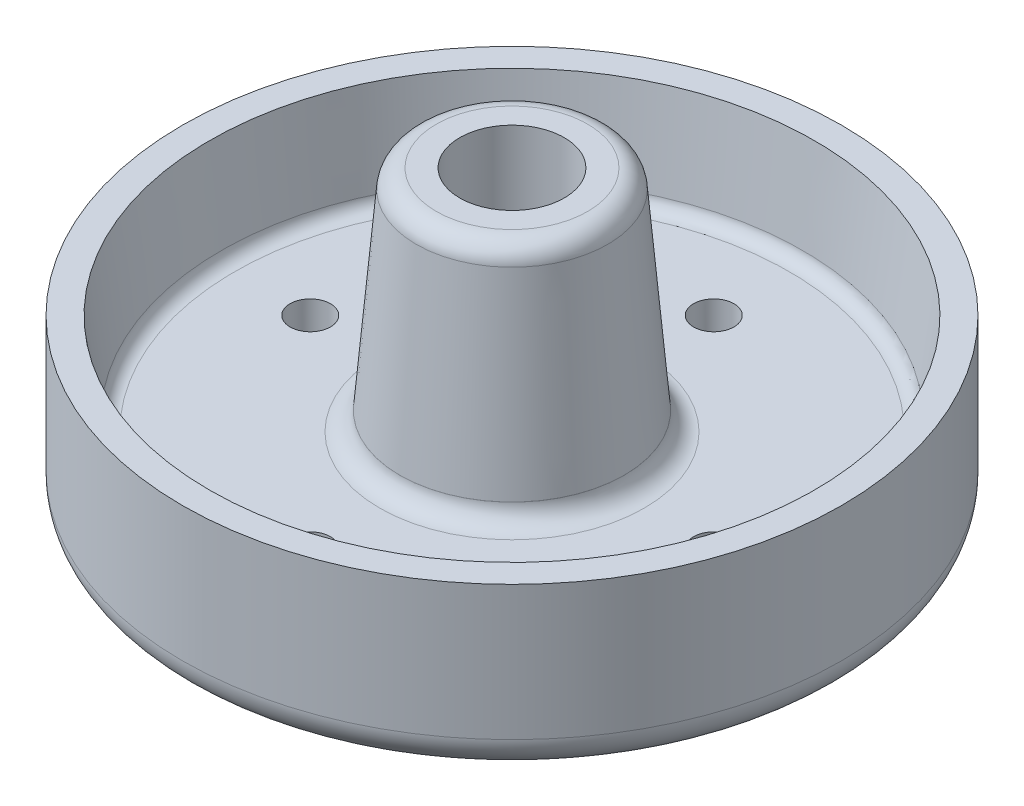
ISO-10303-21;
HEADER;
FILE_DESCRIPTION(('STEP AP214'),'2;1');
FILE_NAME('part.step','',(''),(''),'','','');
FILE_SCHEMA(('AUTOMOTIVE_DESIGN { 1 0 10303 214 1 1 1 1 }'));
ENDSEC;
DATA;
#1=APPLICATION_CONTEXT('core data for automotive mechanical design processes');
#2=APPLICATION_PROTOCOL_DEFINITION('international standard','automotive_design',2000,#1);
#3=PRODUCT_CONTEXT('',#1,'mechanical');
#4=PRODUCT('Part','Part','',(#3));
#5=PRODUCT_RELATED_PRODUCT_CATEGORY('part','',(#4));
#6=PRODUCT_DEFINITION_FORMATION('','',#4);
#7=PRODUCT_DEFINITION_CONTEXT('part definition',#1,'design');
#8=PRODUCT_DEFINITION('design','',#6,#7);
#9=PRODUCT_DEFINITION_SHAPE('','',#8);
#10=(LENGTH_UNIT() NAMED_UNIT(*) SI_UNIT(.MILLI.,.METRE.));
#11=(NAMED_UNIT(*) PLANE_ANGLE_UNIT() SI_UNIT($,.RADIAN.));
#12=(NAMED_UNIT(*) SI_UNIT($,.STERADIAN.) SOLID_ANGLE_UNIT());
#13=UNCERTAINTY_MEASURE_WITH_UNIT(LENGTH_MEASURE(1.E-05),#10,'distance_accuracy_value','');
#14=(GEOMETRIC_REPRESENTATION_CONTEXT(3) GLOBAL_UNCERTAINTY_ASSIGNED_CONTEXT((#13)) GLOBAL_UNIT_ASSIGNED_CONTEXT((#10,
#11,#12)) REPRESENTATION_CONTEXT('',''));
#15=CARTESIAN_POINT('',(0.,0.,0.));
#16=DIRECTION('',(0.,0.,1.));
#17=DIRECTION('',(1.,0.,0.));
#18=AXIS2_PLACEMENT_3D('',#15,#16,#17);
#19=CARTESIAN_POINT('',(-30.,0.,3.14233320495882E-13));
#20=DIRECTION('',(0.,-1.,0.));
#21=DIRECTION('',(1.,0.,0.));
#22=AXIS2_PLACEMENT_3D('',#19,#20,#21);
#23=CYLINDRICAL_SURFACE('',#22,3.);
#24=CARTESIAN_POINT('',(-30.,-43.9999999999994,3.14233320495882E-13));
#25=DIRECTION('',(0.,-1.,0.));
#26=DIRECTION('',(1.,0.,0.));
#27=AXIS2_PLACEMENT_3D('',#24,#25,#26);
#28=CIRCLE('',#27,3.);
#29=CARTESIAN_POINT('',(-27.,-43.9999999999994,2.82809988446294E-13));
#30=VERTEX_POINT('',#29);
#31=EDGE_CURVE('E37',#30,#30,#28,.T.);
#32=ORIENTED_EDGE('',*,*,#31,.T.);
#33=EDGE_LOOP('',(#32));
#34=FACE_BOUND('',#33,.T.);
#35=CARTESIAN_POINT('',(-30.,-34.,3.14233320495882E-13));
#36=DIRECTION('',(0.,1.,0.));
#37=DIRECTION('',(-1.,0.,0.));
#38=AXIS2_PLACEMENT_3D('',#35,#36,#37);
#39=CIRCLE('',#38,3.);
#40=CARTESIAN_POINT('',(-33.,-34.,3.4565665254547E-13));
#41=VERTEX_POINT('',#40);
#42=EDGE_CURVE('E10',#41,#41,#39,.T.);
#43=ORIENTED_EDGE('',*,*,#42,.T.);
#44=EDGE_LOOP('',(#43));
#45=FACE_BOUND('',#44,.T.);
#46=ADVANCED_FACE('F31',(#34,#45),#23,.F.);
#47=CARTESIAN_POINT('',(0.,0.,-30.));
#48=DIRECTION('',(0.,-1.,0.));
#49=DIRECTION('',(0.,0.,1.));
#50=AXIS2_PLACEMENT_3D('',#47,#48,#49);
#51=CYLINDRICAL_SURFACE('',#50,3.);
#52=CARTESIAN_POINT('',(0.,-43.9999999999994,-30.));
#53=DIRECTION('',(0.,-1.,0.));
#54=DIRECTION('',(0.,0.,1.));
#55=AXIS2_PLACEMENT_3D('',#52,#53,#54);
#56=CIRCLE('',#55,3.);
#57=CARTESIAN_POINT('',(0.,-43.9999999999994,-27.));
#58=VERTEX_POINT('',#57);
#59=EDGE_CURVE('E45',#58,#58,#56,.T.);
#60=ORIENTED_EDGE('',*,*,#59,.T.);
#61=EDGE_LOOP('',(#60));
#62=FACE_BOUND('',#61,.T.);
#63=CARTESIAN_POINT('',(0.,-34.,-30.));
#64=DIRECTION('',(0.,1.,0.));
#65=DIRECTION('',(0.,0.,-1.));
#66=AXIS2_PLACEMENT_3D('',#63,#64,#65);
#67=CIRCLE('',#66,3.);
#68=CARTESIAN_POINT('',(0.,-34.,-33.));
#69=VERTEX_POINT('',#68);
#70=EDGE_CURVE('E41',#69,#69,#67,.T.);
#71=ORIENTED_EDGE('',*,*,#70,.T.);
#72=EDGE_LOOP('',(#71));
#73=FACE_BOUND('',#72,.T.);
#74=ADVANCED_FACE('F207',(#62,#73),#51,.F.);
#75=CARTESIAN_POINT('',(30.,0.,-1.04744440165294E-13));
#76=DIRECTION('',(0.,-1.,0.));
#77=DIRECTION('',(-1.,0.,0.));
#78=AXIS2_PLACEMENT_3D('',#75,#76,#77);
#79=CYLINDRICAL_SURFACE('',#78,3.);
#80=CARTESIAN_POINT('',(30.,-43.9999999999994,-1.04744440165294E-13));
#81=DIRECTION('',(0.,-1.,0.));
#82=DIRECTION('',(-1.,0.,0.));
#83=AXIS2_PLACEMENT_3D('',#80,#81,#82);
#84=CIRCLE('',#83,3.);
#85=CARTESIAN_POINT('',(27.,-43.9999999999994,0.));
#86=VERTEX_POINT('',#85);
#87=EDGE_CURVE('E53',#86,#86,#84,.T.);
#88=ORIENTED_EDGE('',*,*,#87,.T.);
#89=EDGE_LOOP('',(#88));
#90=FACE_BOUND('',#89,.T.);
#91=CARTESIAN_POINT('',(30.,-34.,-1.04744440165294E-13));
#92=DIRECTION('',(0.,1.,0.));
#93=DIRECTION('',(1.,0.,0.));
#94=AXIS2_PLACEMENT_3D('',#91,#92,#93);
#95=CIRCLE('',#94,3.);
#96=CARTESIAN_POINT('',(33.,-34.,-1.15218884181823E-13));
#97=VERTEX_POINT('',#96);
#98=EDGE_CURVE('E50',#97,#97,#95,.T.);
#99=ORIENTED_EDGE('',*,*,#98,.T.);
#100=EDGE_LOOP('',(#99));
#101=FACE_BOUND('',#100,.T.);
#102=ADVANCED_FACE('F168',(#90,#101),#79,.F.);
#103=CARTESIAN_POINT('',(0.,-31.2567280767981,0.));
#104=DIRECTION('',(0.,-1.,0.));
#105=DIRECTION('',(0.,0.,-1.));
#106=AXIS2_PLACEMENT_3D('',#103,#104,#105);
#107=CONICAL_SURFACE('',#106,16.6797060848095,0.0880073735307483);
#108=CARTESIAN_POINT('',(0.,-31.2705316366943,0.));
#109=DIRECTION('',(0.,1.,0.));
#110=DIRECTION('',(0.,0.,1.));
#111=AXIS2_PLACEMENT_3D('',#108,#109,#110);
#112=CIRCLE('',#111,16.6809240459768);
#113=CARTESIAN_POINT('',(0.,-31.2705316366943,16.6809240459768));
#114=VERTEX_POINT('',#113);
#115=EDGE_CURVE('E102',#114,#114,#112,.T.);
#116=ORIENTED_EDGE('',*,*,#115,.T.);
#117=EDGE_LOOP('',(#116));
#118=FACE_BOUND('',#117,.T.);
#119=CARTESIAN_POINT('',(0.,-31.2567280767981,0.));
#120=DIRECTION('',(0.,1.,0.));
#121=DIRECTION('',(0.,0.,1.));
#122=AXIS2_PLACEMENT_3D('',#119,#120,#121);
#123=CIRCLE('',#122,16.6797060848095);
#124=CARTESIAN_POINT('',(0.,-31.2567280767981,16.6797060848095));
#125=VERTEX_POINT('',#124);
#126=EDGE_CURVE('E56',#125,#125,#123,.T.);
#127=ORIENTED_EDGE('',*,*,#126,.F.);
#128=EDGE_LOOP('',(#127));
#129=FACE_BOUND('',#128,.T.);
#130=ADVANCED_FACE('F164',(#118,#129),#107,.T.);
#131=CARTESIAN_POINT('',(0.,-2.74445739767555,0.));
#132=DIRECTION('',(0.,-1.,0.));
#133=DIRECTION('',(0.,0.,-1.));
#134=AXIS2_PLACEMENT_3D('',#131,#132,#133);
#135=CONICAL_SURFACE('',#134,14.2421468390724,0.0852842141774929);
#136=ORIENTED_EDGE('',*,*,#126,.T.);
#137=EDGE_LOOP('',(#136));
#138=FACE_BOUND('',#137,.T.);
#139=CARTESIAN_POINT('',(0.,-2.74445739767555,0.));
#140=DIRECTION('',(0.,1.,0.));
#141=DIRECTION('',(0.,0.,1.));
#142=AXIS2_PLACEMENT_3D('',#139,#140,#141);
#143=CIRCLE('',#142,14.2421468390724);
#144=CARTESIAN_POINT('',(0.,-2.74445739767555,14.2421468390724));
#145=VERTEX_POINT('',#144);
#146=EDGE_CURVE('E63',#145,#145,#143,.T.);
#147=ORIENTED_EDGE('',*,*,#146,.F.);
#148=EDGE_LOOP('',(#147));
#149=FACE_BOUND('',#148,.T.);
#150=ADVANCED_FACE('F167',(#138,#149),#135,.T.);
#151=CARTESIAN_POINT('',(0.,-3.,0.));
#152=DIRECTION('',(0.,1.,0.));
#153=DIRECTION('',(0.,0.,1.));
#154=AXIS2_PLACEMENT_3D('',#151,#152,#153);
#155=TOROIDAL_SURFACE('',#154,11.2530503236689,3.);
#156=ORIENTED_EDGE('',*,*,#146,.T.);
#157=EDGE_LOOP('',(#156));
#158=FACE_BOUND('',#157,.T.);
#159=CARTESIAN_POINT('',(0.,0.,0.));
#160=DIRECTION('',(0.,1.,0.));
#161=DIRECTION('',(0.,0.,1.));
#162=AXIS2_PLACEMENT_3D('',#159,#160,#161);
#163=CIRCLE('',#162,11.2530503236689);
#164=CARTESIAN_POINT('',(0.,0.,11.2530503236689));
#165=VERTEX_POINT('',#164);
#166=EDGE_CURVE('E66',#165,#165,#163,.T.);
#167=ORIENTED_EDGE('',*,*,#166,.F.);
#168=EDGE_LOOP('',(#167));
#169=FACE_BOUND('',#168,.T.);
#170=ADVANCED_FACE('F174',(#158,#169),#155,.T.);
#171=CARTESIAN_POINT('',(-11.2530503236689,0.,0.));
#172=DIRECTION('',(0.,1.,0.));
#173=DIRECTION('',(0.,0.,1.));
#174=AXIS2_PLACEMENT_3D('',#171,#172,#173);
#175=PLANE('',#174);
#176=ORIENTED_EDGE('',*,*,#166,.T.);
#177=EDGE_LOOP('',(#176));
#178=FACE_BOUND('',#177,.T.);
#179=CARTESIAN_POINT('',(0.,0.,0.));
#180=DIRECTION('',(0.,1.,0.));
#181=DIRECTION('',(0.,0.,1.));
#182=AXIS2_PLACEMENT_3D('',#179,#180,#181);
#183=CIRCLE('',#182,7.77715208176271);
#184=CARTESIAN_POINT('',(0.,0.,7.77715208176271));
#185=VERTEX_POINT('',#184);
#186=EDGE_CURVE('E69',#185,#185,#183,.T.);
#187=ORIENTED_EDGE('',*,*,#186,.F.);
#188=EDGE_LOOP('',(#187));
#189=FACE_BOUND('',#188,.T.);
#190=ADVANCED_FACE('F180',(#178,#189),#175,.T.);
#191=CARTESIAN_POINT('',(0.,0.,0.));
#192=DIRECTION('',(0.,1.,0.));
#193=DIRECTION('',(0.,0.,1.));
#194=AXIS2_PLACEMENT_3D('',#191,#192,#193);
#195=CYLINDRICAL_SURFACE('',#194,7.77715208176271);
#196=ORIENTED_EDGE('',*,*,#186,.T.);
#197=EDGE_LOOP('',(#196));
#198=FACE_BOUND('',#197,.T.);
#199=CARTESIAN_POINT('',(0.,-47.,0.));
#200=DIRECTION('',(0.,1.,0.));
#201=DIRECTION('',(0.,0.,1.));
#202=AXIS2_PLACEMENT_3D('',#199,#200,#201);
#203=CIRCLE('',#202,7.7771520817627);
#204=CARTESIAN_POINT('',(0.,-47.,7.7771520817627));
#205=VERTEX_POINT('',#204);
#206=EDGE_CURVE('E72',#205,#205,#203,.T.);
#207=ORIENTED_EDGE('',*,*,#206,.F.);
#208=EDGE_LOOP('',(#207));
#209=FACE_BOUND('',#208,.T.);
#210=ADVANCED_FACE('F186',(#198,#209),#195,.F.);
#211=CARTESIAN_POINT('',(-7.7771520817627,-47.,0.));
#212=DIRECTION('',(0.,-1.,0.));
#213=DIRECTION('',(0.,0.,-1.));
#214=AXIS2_PLACEMENT_3D('',#211,#212,#213);
#215=PLANE('',#214);
#216=ORIENTED_EDGE('',*,*,#206,.T.);
#217=EDGE_LOOP('',(#216));
#218=FACE_BOUND('',#217,.T.);
#219=CARTESIAN_POINT('',(0.,-47.,0.));
#220=DIRECTION('',(0.,1.,0.));
#221=DIRECTION('',(0.,0.,1.));
#222=AXIS2_PLACEMENT_3D('',#219,#220,#221);
#223=CIRCLE('',#222,17.);
#224=CARTESIAN_POINT('',(0.,-47.,17.));
#225=VERTEX_POINT('',#224);
#226=EDGE_CURVE('E75',#225,#225,#223,.T.);
#227=ORIENTED_EDGE('',*,*,#226,.F.);
#228=EDGE_LOOP('',(#227));
#229=FACE_BOUND('',#228,.T.);
#230=ADVANCED_FACE('F192',(#218,#229),#215,.T.);
#231=CARTESIAN_POINT('',(0.,0.,0.));
#232=DIRECTION('',(0.,1.,0.));
#233=DIRECTION('',(0.,0.,1.));
#234=AXIS2_PLACEMENT_3D('',#231,#232,#233);
#235=CYLINDRICAL_SURFACE('',#234,17.);
#236=ORIENTED_EDGE('',*,*,#226,.T.);
#237=EDGE_LOOP('',(#236));
#238=FACE_BOUND('',#237,.T.);
#239=CARTESIAN_POINT('',(0.,-43.9999999999994,0.));
#240=DIRECTION('',(0.,1.,0.));
#241=DIRECTION('',(0.,0.,1.));
#242=AXIS2_PLACEMENT_3D('',#239,#240,#241);
#243=CIRCLE('',#242,17.);
#244=CARTESIAN_POINT('',(0.,-43.9999999999994,17.));
#245=VERTEX_POINT('',#244);
#246=EDGE_CURVE('E78',#245,#245,#243,.T.);
#247=ORIENTED_EDGE('',*,*,#246,.F.);
#248=EDGE_LOOP('',(#247));
#249=FACE_BOUND('',#248,.T.);
#250=ADVANCED_FACE('F115',(#238,#249),#235,.T.);
#251=CARTESIAN_POINT('',(-44.,-43.9999999999994,0.));
#252=DIRECTION('',(0.,-1.,0.));
#253=DIRECTION('',(0.,0.,-1.));
#254=AXIS2_PLACEMENT_3D('',#251,#252,#253);
#255=PLANE('',#254);
#256=ORIENTED_EDGE('',*,*,#31,.F.);
#257=EDGE_LOOP('',(#256));
#258=FACE_BOUND('',#257,.T.);
#259=ORIENTED_EDGE('',*,*,#59,.F.);
#260=EDGE_LOOP('',(#259));
#261=FACE_BOUND('',#260,.T.);
#262=ORIENTED_EDGE('',*,*,#87,.F.);
#263=EDGE_LOOP('',(#262));
#264=FACE_BOUND('',#263,.T.);
#265=CARTESIAN_POINT('',(0.,-43.9999999999994,30.));
#266=DIRECTION('',(0.,-1.,0.));
#267=DIRECTION('',(0.,0.,-1.));
#268=AXIS2_PLACEMENT_3D('',#265,#266,#267);
#269=CIRCLE('',#268,3.);
#270=CARTESIAN_POINT('',(0.,-43.9999999999994,27.));
#271=VERTEX_POINT('',#270);
#272=EDGE_CURVE('E60',#271,#271,#269,.T.);
#273=ORIENTED_EDGE('',*,*,#272,.F.);
#274=EDGE_LOOP('',(#273));
#275=FACE_BOUND('',#274,.T.);
#276=ORIENTED_EDGE('',*,*,#246,.T.);
#277=EDGE_LOOP('',(#276));
#278=FACE_BOUND('',#277,.T.);
#279=CARTESIAN_POINT('',(0.,-43.9999999999994,0.));
#280=DIRECTION('',(0.,1.,0.));
#281=DIRECTION('',(0.,0.,1.));
#282=AXIS2_PLACEMENT_3D('',#279,#280,#281);
#283=CIRCLE('',#282,44.);
#284=CARTESIAN_POINT('',(0.,-43.9999999999994,44.));
#285=VERTEX_POINT('',#284);
#286=EDGE_CURVE('E81',#285,#285,#283,.T.);
#287=ORIENTED_EDGE('',*,*,#286,.F.);
#288=EDGE_LOOP('',(#287));
#289=FACE_BOUND('',#288,.T.);
#290=ADVANCED_FACE('F111',(#258,#261,#264,#275,#278,#289),#255,.T.);
#291=CARTESIAN_POINT('',(0.,-38.9999999999994,0.));
#292=DIRECTION('',(0.,1.,0.));
#293=DIRECTION('',(0.,0.,1.));
#294=AXIS2_PLACEMENT_3D('',#291,#292,#293);
#295=TOROIDAL_SURFACE('',#294,44.,5.);
#296=ORIENTED_EDGE('',*,*,#286,.T.);
#297=EDGE_LOOP('',(#296));
#298=FACE_BOUND('',#297,.T.);
#299=CARTESIAN_POINT('',(0.,-38.9999999999994,0.));
#300=DIRECTION('',(0.,1.,0.));
#301=DIRECTION('',(0.,0.,1.));
#302=AXIS2_PLACEMENT_3D('',#299,#300,#301);
#303=CIRCLE('',#302,49.);
#304=CARTESIAN_POINT('',(0.,-38.9999999999994,49.));
#305=VERTEX_POINT('',#304);
#306=EDGE_CURVE('E84',#305,#305,#303,.T.);
#307=ORIENTED_EDGE('',*,*,#306,.F.);
#308=EDGE_LOOP('',(#307));
#309=FACE_BOUND('',#308,.T.);
#310=ADVANCED_FACE('F114',(#298,#309),#295,.T.);
#311=CARTESIAN_POINT('',(0.,0.,0.));
#312=DIRECTION('',(0.,1.,0.));
#313=DIRECTION('',(0.,0.,1.));
#314=AXIS2_PLACEMENT_3D('',#311,#312,#313);
#315=CYLINDRICAL_SURFACE('',#314,49.);
#316=ORIENTED_EDGE('',*,*,#306,.T.);
#317=EDGE_LOOP('',(#316));
#318=FACE_BOUND('',#317,.T.);
#319=CARTESIAN_POINT('',(0.,-18.9999999999994,0.));
#320=DIRECTION('',(0.,1.,0.));
#321=DIRECTION('',(0.,0.,1.));
#322=AXIS2_PLACEMENT_3D('',#319,#320,#321);
#323=CIRCLE('',#322,49.);
#324=CARTESIAN_POINT('',(0.,-18.9999999999994,49.));
#325=VERTEX_POINT('',#324);
#326=EDGE_CURVE('E87',#325,#325,#323,.T.);
#327=ORIENTED_EDGE('',*,*,#326,.F.);
#328=EDGE_LOOP('',(#327));
#329=FACE_BOUND('',#328,.T.);
#330=ADVANCED_FACE('F124',(#318,#329),#315,.T.);
#331=CARTESIAN_POINT('',(-45.,-18.9999999999994,0.));
#332=DIRECTION('',(0.,1.,0.));
#333=DIRECTION('',(0.,0.,1.));
#334=AXIS2_PLACEMENT_3D('',#331,#332,#333);
#335=PLANE('',#334);
#336=ORIENTED_EDGE('',*,*,#326,.T.);
#337=EDGE_LOOP('',(#336));
#338=FACE_BOUND('',#337,.T.);
#339=CARTESIAN_POINT('',(0.,-18.9999999999994,0.));
#340=DIRECTION('',(0.,1.,0.));
#341=DIRECTION('',(0.,0.,1.));
#342=AXIS2_PLACEMENT_3D('',#339,#340,#341);
#343=CIRCLE('',#342,45.);
#344=CARTESIAN_POINT('',(0.,-18.9999999999994,45.));
#345=VERTEX_POINT('',#344);
#346=EDGE_CURVE('E90',#345,#345,#343,.T.);
#347=ORIENTED_EDGE('',*,*,#346,.F.);
#348=EDGE_LOOP('',(#347));
#349=FACE_BOUND('',#348,.T.);
#350=ADVANCED_FACE('F130',(#338,#349),#335,.T.);
#351=CARTESIAN_POINT('',(0.,-32.264327440182,0.));
#352=DIRECTION('',(0.,1.,0.));
#353=DIRECTION('',(0.,0.,1.));
#354=AXIS2_PLACEMENT_3D('',#351,#352,#353);
#355=CONICAL_SURFACE('',#354,43.2314230079757,0.132551532296668);
#356=ORIENTED_EDGE('',*,*,#346,.T.);
#357=EDGE_LOOP('',(#356));
#358=FACE_BOUND('',#357,.T.);
#359=CARTESIAN_POINT('',(0.,-32.264327440182,0.));
#360=DIRECTION('',(0.,1.,0.));
#361=DIRECTION('',(0.,0.,1.));
#362=AXIS2_PLACEMENT_3D('',#359,#360,#361);
#363=CIRCLE('',#362,43.2314230079757);
#364=CARTESIAN_POINT('',(0.,-32.264327440182,43.2314230079757));
#365=VERTEX_POINT('',#364);
#366=EDGE_CURVE('E93',#365,#365,#363,.T.);
#367=ORIENTED_EDGE('',*,*,#366,.F.);
#368=EDGE_LOOP('',(#367));
#369=FACE_BOUND('',#368,.T.);
#370=ADVANCED_FACE('F136',(#358,#369),#355,.F.);
#371=CARTESIAN_POINT('',(0.,-32.,0.));
#372=DIRECTION('',(0.,1.,0.));
#373=DIRECTION('',(0.,0.,1.));
#374=AXIS2_PLACEMENT_3D('',#371,#372,#373);
#375=TOROIDAL_SURFACE('',#374,41.2489672066105,2.);
#376=ORIENTED_EDGE('',*,*,#366,.T.);
#377=EDGE_LOOP('',(#376));
#378=FACE_BOUND('',#377,.T.);
#379=CARTESIAN_POINT('',(0.,-34.,0.));
#380=DIRECTION('',(0.,1.,0.));
#381=DIRECTION('',(0.,0.,1.));
#382=AXIS2_PLACEMENT_3D('',#379,#380,#381);
#383=CIRCLE('',#382,41.2489672066104);
#384=CARTESIAN_POINT('',(0.,-34.,41.2489672066104));
#385=VERTEX_POINT('',#384);
#386=EDGE_CURVE('E96',#385,#385,#383,.T.);
#387=ORIENTED_EDGE('',*,*,#386,.F.);
#388=EDGE_LOOP('',(#387));
#389=FACE_BOUND('',#388,.T.);
#390=ADVANCED_FACE('F142',(#378,#389),#375,.F.);
#391=CARTESIAN_POINT('',(-41.2489672066104,-34.,0.));
#392=DIRECTION('',(0.,1.,0.));
#393=DIRECTION('',(0.,0.,1.));
#394=AXIS2_PLACEMENT_3D('',#391,#392,#393);
#395=PLANE('',#394);
#396=ORIENTED_EDGE('',*,*,#42,.F.);
#397=EDGE_LOOP('',(#396));
#398=FACE_BOUND('',#397,.T.);
#399=ORIENTED_EDGE('',*,*,#70,.F.);
#400=EDGE_LOOP('',(#399));
#401=FACE_BOUND('',#400,.T.);
#402=ORIENTED_EDGE('',*,*,#98,.F.);
#403=EDGE_LOOP('',(#402));
#404=FACE_BOUND('',#403,.T.);
#405=CARTESIAN_POINT('',(0.,-34.,30.));
#406=DIRECTION('',(0.,1.,0.));
#407=DIRECTION('',(0.,0.,1.));
#408=AXIS2_PLACEMENT_3D('',#405,#406,#407);
#409=CIRCLE('',#408,3.);
#410=CARTESIAN_POINT('',(0.,-34.,33.));
#411=VERTEX_POINT('',#410);
#412=EDGE_CURVE('E57',#411,#411,#409,.T.);
#413=ORIENTED_EDGE('',*,*,#412,.F.);
#414=EDGE_LOOP('',(#413));
#415=FACE_BOUND('',#414,.T.);
#416=ORIENTED_EDGE('',*,*,#386,.T.);
#417=EDGE_LOOP('',(#416));
#418=FACE_BOUND('',#417,.T.);
#419=CARTESIAN_POINT('',(0.,-34.,0.));
#420=DIRECTION('',(0.,1.,0.));
#421=DIRECTION('',(0.,0.,1.));
#422=AXIS2_PLACEMENT_3D('',#419,#420,#421);
#423=CIRCLE('',#422,19.6687012521199);
#424=CARTESIAN_POINT('',(0.,-34.,19.6687012521199));
#425=VERTEX_POINT('',#424);
#426=EDGE_CURVE('E99',#425,#425,#423,.T.);
#427=ORIENTED_EDGE('',*,*,#426,.F.);
#428=EDGE_LOOP('',(#427));
#429=FACE_BOUND('',#428,.T.);
#430=ADVANCED_FACE('F148',(#398,#401,#404,#415,#418,#429),#395,.T.);
#431=CARTESIAN_POINT('',(0.,-31.,0.));
#432=DIRECTION('',(0.,1.,0.));
#433=DIRECTION('',(0.,0.,1.));
#434=AXIS2_PLACEMENT_3D('',#431,#432,#433);
#435=TOROIDAL_SURFACE('',#434,19.6687012521199,3.00000000000004);
#436=ORIENTED_EDGE('',*,*,#426,.T.);
#437=EDGE_LOOP('',(#436));
#438=FACE_BOUND('',#437,.T.);
#439=ORIENTED_EDGE('',*,*,#115,.F.);
#440=EDGE_LOOP('',(#439));
#441=FACE_BOUND('',#440,.T.);
#442=ADVANCED_FACE('F154',(#438,#441),#435,.F.);
#443=CARTESIAN_POINT('',(0.,0.,30.));
#444=DIRECTION('',(0.,-1.,0.));
#445=DIRECTION('',(0.,0.,-1.));
#446=AXIS2_PLACEMENT_3D('',#443,#444,#445);
#447=CYLINDRICAL_SURFACE('',#446,3.);
#448=ORIENTED_EDGE('',*,*,#272,.T.);
#449=EDGE_LOOP('',(#448));
#450=FACE_BOUND('',#449,.T.);
#451=ORIENTED_EDGE('',*,*,#412,.T.);
#452=EDGE_LOOP('',(#451));
#453=FACE_BOUND('',#452,.T.);
#454=ADVANCED_FACE('F108',(#450,#453),#447,.F.);
#455=CLOSED_SHELL('',(#46,#74,#102,#130,#150,#170,#190,#210,#230,#250,#290,#310,#330,#350,#370,
#390,#430,#442,#454));
#456=MANIFOLD_SOLID_BREP('B2',#455);
#457=ADVANCED_BREP_SHAPE_REPRESENTATION('',(#18,#456),#14);
#458=SHAPE_DEFINITION_REPRESENTATION(#9,#457);
ENDSEC;
END-ISO-10303-21;
